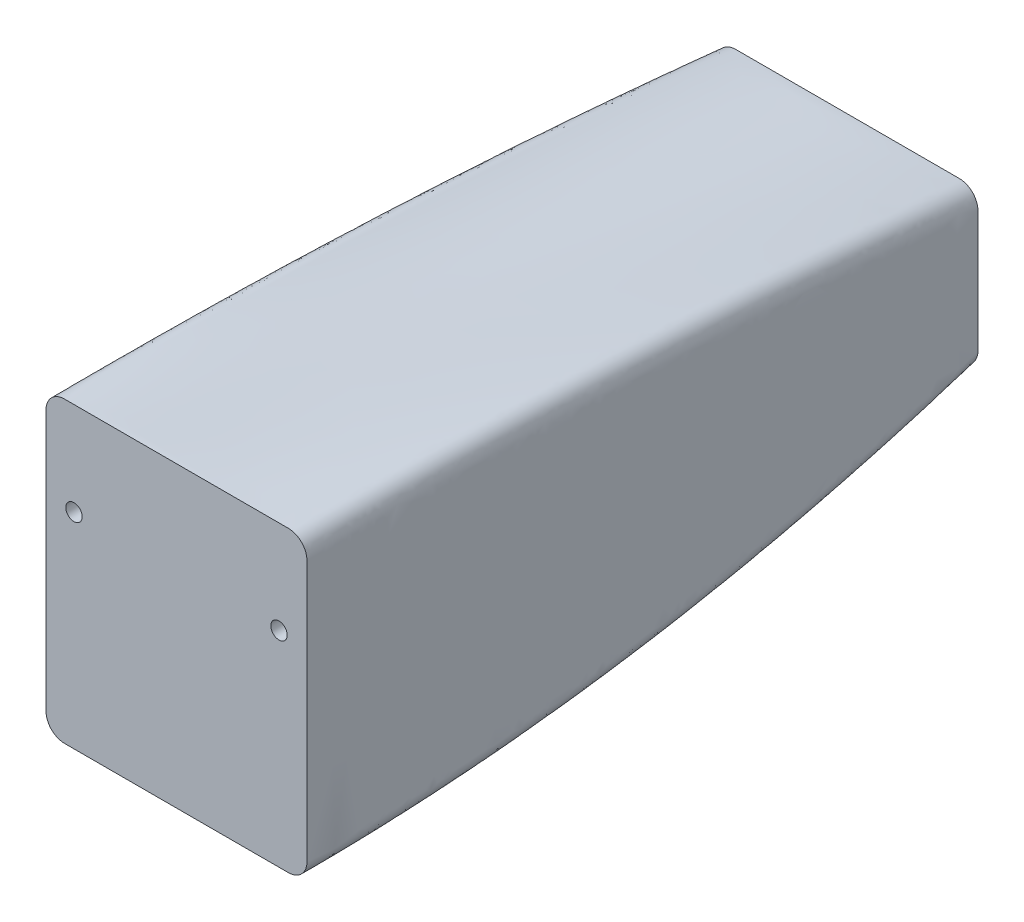
ISO-10303-21;
HEADER;
FILE_DESCRIPTION(('STEP AP214'),'2;1');
FILE_NAME('part.step','',(''),(''),'','','');
FILE_SCHEMA(('AUTOMOTIVE_DESIGN { 1 0 10303 214 1 1 1 1 }'));
ENDSEC;
DATA;
#1=APPLICATION_CONTEXT('core data for automotive mechanical design processes');
#2=APPLICATION_PROTOCOL_DEFINITION('international standard','automotive_design',2000,#1);
#3=PRODUCT_CONTEXT('',#1,'mechanical');
#4=PRODUCT('Part','Part','',(#3));
#5=PRODUCT_RELATED_PRODUCT_CATEGORY('part','',(#4));
#6=PRODUCT_DEFINITION_FORMATION('','',#4);
#7=PRODUCT_DEFINITION_CONTEXT('part definition',#1,'design');
#8=PRODUCT_DEFINITION('design','',#6,#7);
#9=PRODUCT_DEFINITION_SHAPE('','',#8);
#10=(LENGTH_UNIT() NAMED_UNIT(*) SI_UNIT(.MILLI.,.METRE.));
#11=(NAMED_UNIT(*) PLANE_ANGLE_UNIT() SI_UNIT($,.RADIAN.));
#12=(NAMED_UNIT(*) SI_UNIT($,.STERADIAN.) SOLID_ANGLE_UNIT());
#13=UNCERTAINTY_MEASURE_WITH_UNIT(LENGTH_MEASURE(1.E-05),#10,'distance_accuracy_value','');
#14=(GEOMETRIC_REPRESENTATION_CONTEXT(3) GLOBAL_UNCERTAINTY_ASSIGNED_CONTEXT((#13)) GLOBAL_UNIT_ASSIGNED_CONTEXT((#10,
#11,#12)) REPRESENTATION_CONTEXT('',''));
#15=CARTESIAN_POINT('',(0.,0.,0.));
#16=DIRECTION('',(0.,0.,1.));
#17=DIRECTION('',(1.,0.,0.));
#18=AXIS2_PLACEMENT_3D('',#15,#16,#17);
#19=CARTESIAN_POINT('',(-152.4,203.2,0.));
#20=CARTESIAN_POINT('',(-152.4,203.2,-76.289978704247));
#21=CARTESIAN_POINT('',(-152.399999999999,201.347916666664,-228.824946760615));
#22=CARTESIAN_POINT('',(-152.4,193.013541666668,-457.492430788806));
#23=CARTESIAN_POINT('',(-152.4,179.122916666665,-686.024946760615));
#24=CARTESIAN_POINT('',(-152.4,166.158333333333,-838.289978704247));
#25=CARTESIAN_POINT('',(-152.4,158.75,-914.4));
#26=CARTESIAN_POINT('',(-126.997882380431,203.2,0.));
#27=CARTESIAN_POINT('',(-126.998237758365,200.617013574214,-80.7921401352914));
#28=CARTESIAN_POINT('',(-126.998900053607,195.12526755,-235.53205080147));
#29=CARTESIAN_POINT('',(-126.999820805528,185.38199086321,-457.342481945236));
#30=CARTESIAN_POINT('',(-127.000741557449,173.604718393396,-679.087152191198));
#31=CARTESIAN_POINT('',(-127.00140385269,164.044980803145,-833.695541061777));
#32=CARTESIAN_POINT('',(-127.001759230624,158.750000000001,-914.400000000002));
#33=CARTESIAN_POINT('',(-76.1934056008883,203.2,0.));
#34=CARTESIAN_POINT('',(-76.1944596135134,197.84697607519,-85.460061123432));
#35=CARTESIAN_POINT('',(-76.1964194511055,188.452003717235,-242.491024038454));
#36=CARTESIAN_POINT('',(-76.1991473196214,177.197799223124,-457.202638478264));
#37=CARTESIAN_POINT('',(-76.2018789117132,167.686895859023,-671.913052111083));
#38=CARTESIAN_POINT('',(-76.2038436670242,161.778586485762,-828.941541190255));
#39=CARTESIAN_POINT('',(-76.2048976796493,158.75,-914.4));
#40=CARTESIAN_POINT('',(0.0101718947397991,203.2,0.));
#41=CARTESIAN_POINT('',(0.00854512829626252,198.394731070075,-84.1447095902575));
#42=CARTESIAN_POINT('',(0.0055279178554285,189.771614024762,-240.542565714426));
#43=CARTESIAN_POINT('',(0.00132280660836823,178.816188892012,-457.281606391949));
#44=CARTESIAN_POINT('',(-0.00289440625630244,168.857065624015,-673.983037675546));
#45=CARTESIAN_POINT('',(-0.00592759928524754,162.226749663394,-830.305440290817));
#46=CARTESIAN_POINT('',(-0.007554365728922,158.75,-914.4));
#47=CARTESIAN_POINT('',(76.2090542391531,203.2,0.));
#48=CARTESIAN_POINT('',(76.2076055518368,201.160302494155,-79.2040976481552));
#49=CARTESIAN_POINT('',(76.2049235601321,196.434133243936,-233.185975565563));
#50=CARTESIAN_POINT('',(76.2011820724959,186.987202918433,-457.457877873416));
#51=CARTESIAN_POINT('',(76.1974256905623,174.765320485615,-681.610827433119));
#52=CARTESIAN_POINT('',(76.1947240279792,164.48948991946,-835.354510966809));
#53=CARTESIAN_POINT('',(76.1932753406628,158.75,-914.4));
#54=CARTESIAN_POINT('',(127.003739298264,203.2,0.));
#55=CARTESIAN_POINT('',(127.003130464352,202.825897853524,-76.6214978184402));
#56=CARTESIAN_POINT('',(127.002004736661,200.446687234466,-229.328685152875));
#57=CARTESIAN_POINT('',(127.000433268093,191.908259993415,-457.512641542004));
#58=CARTESIAN_POINT('',(126.998854352375,178.323668144457,-685.552335739221));
#59=CARTESIAN_POINT('',(126.997718789246,165.852249758944,-837.970854246146));
#60=CARTESIAN_POINT('',(126.997109955333,158.75,-914.400000000001));
#61=CARTESIAN_POINT('',(154.061191964758,203.2,0.));
#62=CARTESIAN_POINT('',(154.061231789125,203.224470353609,-76.2682937445936));
#63=CARTESIAN_POINT('',(154.061305423972,201.406866884129,-228.791996785049));
#64=CARTESIAN_POINT('',(154.061408215128,193.085839122422,-457.491108785492));
#65=CARTESIAN_POINT('',(154.061511493407,179.175196222247,-686.055860667209));
#66=CARTESIAN_POINT('',(154.0615857716,166.178354531741,-838.310852918438));
#67=CARTESIAN_POINT('',(154.061625595966,158.75,-914.4));
#68=CARTESIAN_POINT('',(157.277351192376,202.875605593419,0.));
#69=CARTESIAN_POINT('',(157.302748002236,202.944809891288,-76.2331368313615));
#70=CARTESIAN_POINT('',(157.350076632585,201.190110354134,-228.738290001684));
#71=CARTESIAN_POINT('',(157.415876262133,192.892906398944,-457.488057521071));
#72=CARTESIAN_POINT('',(157.481677384916,178.944709715774,-686.104868617123));
#73=CARTESIAN_POINT('',(157.529007987383,165.888000370721,-838.344137903394));
#74=CARTESIAN_POINT('',(157.554404797243,158.422533288273,-914.400000000001));
#75=CARTESIAN_POINT('',(161.745725705935,201.566761344456,0.));
#76=CARTESIAN_POINT('',(161.85719397524,201.650577178658,-76.2018997428054));
#77=CARTESIAN_POINT('',(162.064926792692,199.898886193079,-228.689859196821));
#78=CARTESIAN_POINT('',(162.353728602105,191.530553961633,-457.483088829511));
#79=CARTESIAN_POINT('',(162.64253333666,177.438582852026,-686.145648762115));
#80=CARTESIAN_POINT('',(162.85027001735,164.239566406383,-838.372325551655));
#81=CARTESIAN_POINT('',(162.961738286654,156.691835508826,-914.399999999999));
#82=CARTESIAN_POINT('',(165.837665424983,199.514569024522,0.));
#83=CARTESIAN_POINT('',(166.032498949911,199.54873868353,-76.1890201986105));
#84=CARTESIAN_POINT('',(166.395592874104,197.6878985395,-228.669107629038));
#85=CARTESIAN_POINT('',(166.900385535622,189.116128583717,-457.478558321472));
#86=CARTESIAN_POINT('',(167.405182304081,174.770856005533,-686.159424937194));
#87=CARTESIAN_POINT('',(167.768281652311,161.362943639996,-838.382423871866));
#88=CARTESIAN_POINT('',(167.963115177239,153.69907017061,-914.400000000001));
#89=CARTESIAN_POINT('',(169.511774494994,196.759899801224,1.44738120204081E-13));
#90=CARTESIAN_POINT('',(169.741616271139,196.705160542827,-76.1913574618443));
#91=CARTESIAN_POINT('',(170.169951936683,194.670716591397,-228.671585165225));
#92=CARTESIAN_POINT('',(170.765447186749,185.833004371362,-457.475295975399));
#93=CARTESIAN_POINT('',(171.360947302594,171.198070362486,-686.151924952306));
#94=CARTESIAN_POINT('',(171.789289394371,157.569103481403,-838.378083365132));
#95=CARTESIAN_POINT('',(172.019131170516,149.784688216593,-914.399999999998));
#96=CARTESIAN_POINT('',(172.704730245152,193.307886858374,0.));
#97=CARTESIAN_POINT('',(172.906767946129,193.168824074474,-76.2057707955773));
#98=CARTESIAN_POINT('',(173.283286730919,190.979160171261,-228.692841672278));
#99=CARTESIAN_POINT('',(173.806744019291,181.931652891294,-457.474131769747));
#100=CARTESIAN_POINT('',(174.330206336469,167.092711405698,-686.128876617423));
#101=CARTESIAN_POINT('',(174.706731762804,153.320097080563,-838.362954532583));
#102=CARTESIAN_POINT('',(174.90876946378,145.459073494648,-914.400000000002));
#103=CARTESIAN_POINT('',(174.887047768038,189.824723880882,-1.23268842281302E-13));
#104=CARTESIAN_POINT('',(175.026818438545,189.650891769246,-76.2252280183268));
#105=CARTESIAN_POINT('',(175.287294725424,187.407170746303,-228.722496126284));
#106=CARTESIAN_POINT('',(175.649424202719,178.317905644492,-457.475601697421));
#107=CARTESIAN_POINT('',(176.011558204128,163.469420090984,-686.101485888309));
#108=CARTESIAN_POINT('',(176.272040466004,149.707184384607,-838.344398984863));
#109=CARTESIAN_POINT('',(176.411811136511,141.85434801314,-914.399999999999));
#110=CARTESIAN_POINT('',(176.267371262038,186.626295543058,1.2871974436324E-13));
#111=CARTESIAN_POINT('',(176.350397328331,186.459869291305,-76.243691094844));
#112=CARTESIAN_POINT('',(176.505123354506,184.24458301278,-228.751159041814));
#113=CARTESIAN_POINT('',(176.720233421317,175.240345547358,-457.478656688219));
#114=CARTESIAN_POINT('',(176.93534713773,160.520774180069,-686.077526939975));
#115=CARTESIAN_POINT('',(177.090077983939,146.874760579416,-838.327810884894));
#116=CARTESIAN_POINT('',(177.173104050232,139.087853906591,-914.399999999999));
#117=CARTESIAN_POINT('',(177.086963674345,183.996593571629,-1.28215291471455E-13));
#118=CARTESIAN_POINT('',(177.129389118678,183.856491008348,-76.258594459275));
#119=CARTESIAN_POINT('',(177.208451442463,181.704397741592,-228.774569637985));
#120=CARTESIAN_POINT('',(177.318369719897,172.831962331986,-457.481991202953));
#121=CARTESIAN_POINT('',(177.428290734068,158.286585977708,-686.059250522448));
#122=CARTESIAN_POINT('',(177.507356672266,144.788566190383,-838.314954291659));
#123=CARTESIAN_POINT('',(177.549782116599,137.084515958082,-914.4));
#124=CARTESIAN_POINT('',(177.646695892572,181.09990503322,0.));
#125=CARTESIAN_POINT('',(177.65693999592,181.011078377801,-76.2741612886315));
#126=CARTESIAN_POINT('',(177.676029429083,178.971980719869,-228.799337377042));
#127=CARTESIAN_POINT('',(177.702569731891,170.310846927028,-457.486472736627));
#128=CARTESIAN_POINT('',(177.729111579981,156.029063463017,-686.041382874886));
#129=CARTESIAN_POINT('',(177.748203054003,142.748641261977,-838.302138492805));
#130=CARTESIAN_POINT('',(177.758447157352,135.165600133049,-914.4));
#131=CARTESIAN_POINT('',(177.8,178.947801432061,-1.19329048133977E-13));
#132=CARTESIAN_POINT('',(177.80000008463,178.913753295433,-76.2847197567424));
#133=CARTESIAN_POINT('',(177.799999582751,176.990660801679,-228.816383120578));
#134=CARTESIAN_POINT('',(177.799999360821,168.534074292293,-457.490294269907));
#135=CARTESIAN_POINT('',(177.799999689739,154.498578019263,-686.030220940654));
#136=CARTESIAN_POINT('',(177.79999991537,141.417657014858,-838.293926031581));
#137=CARTESIAN_POINT('',(177.8,133.945057211016,-914.4));
#138=CARTESIAN_POINT('',(177.8,149.439134235658,1.08731525468806E-13));
#139=CARTESIAN_POINT('',(177.799997908886,150.280424902702,-76.419921305873));
#140=CARTESIAN_POINT('',(177.800010309713,150.182897026824,-229.036544549858));
#141=CARTESIAN_POINT('',(177.800015793404,144.868229195493,-457.545221736795));
#142=CARTESIAN_POINT('',(177.800007666189,134.557208308803,-685.894627780375));
#143=CARTESIAN_POINT('',(177.800002091114,124.46719629109,-838.19244474276));
#144=CARTESIAN_POINT('',(177.800000000001,118.646814229079,-914.4));
#145=CARTESIAN_POINT('',(177.8,90.9383271723927,0.));
#146=CARTESIAN_POINT('',(177.799983665125,92.1643911321974,-76.6550355022733));
#147=CARTESIAN_POINT('',(177.800080535026,93.8861220986339,-229.509520450412));
#148=CARTESIAN_POINT('',(177.800123371234,94.527293546052,-457.926459692636));
#149=CARTESIAN_POINT('',(177.80005988495,93.4773632022336,-686.008593897138));
#150=CARTESIAN_POINT('',(177.800016334875,91.8186245111077,-838.191406555604));
#151=CARTESIAN_POINT('',(177.8,90.7909120910423,-914.399999999999));
#152=CARTESIAN_POINT('',(177.8,0.0079139873784885,0.));
#153=CARTESIAN_POINT('',(177.799957105835,-0.110809432631002,-76.9250565213651));
#154=CARTESIAN_POINT('',(177.800211478985,1.83869962413879,-230.223555546046));
#155=CARTESIAN_POINT('',(177.800323963673,11.2968682439637,-458.912537425807));
#156=CARTESIAN_POINT('',(177.800157253422,27.2634428121314,-686.812388499132));
#157=CARTESIAN_POINT('',(177.800042894166,42.2343169232783,-838.527210689867));
#158=CARTESIAN_POINT('',(177.8,50.7961623228312,-914.4));
#159=CARTESIAN_POINT('',(177.8,-90.9262006583948,1.66553288356187E-13));
#160=CARTESIAN_POINT('',(177.799950343851,-92.3350950147008,-77.1040900099978));
#161=CARTESIAN_POINT('',(177.800244817257,-90.0809917571816,-230.797392165084));
#162=CARTESIAN_POINT('',(177.800375034417,-71.7754444363253,-459.900088578201));
#163=CARTESIAN_POINT('',(177.80018204339,-38.8350938652442,-687.758061723106));
#164=CARTESIAN_POINT('',(177.800049656149,-7.30611317419731,-838.955648446669));
#165=CARTESIAN_POINT('',(177.8,10.8011824179243,-914.400000000001));
#166=CARTESIAN_POINT('',(177.8,-149.434941907144,0.));
#167=CARTESIAN_POINT('',(177.799975694704,-150.349311589992,-77.1572291454801));
#168=CARTESIAN_POINT('',(177.800119831199,-146.121350985685,-230.989971112449));
#169=CARTESIAN_POINT('',(177.800183568859,-121.79785795889,-460.284273372492));
#170=CARTESIAN_POINT('',(177.800089105147,-79.6805312931429,-688.15578508383));
#171=CARTESIAN_POINT('',(177.800024305296,-39.8623234366139,-839.139877504594));
#172=CARTESIAN_POINT('',(177.8,-17.0500549629847,-914.4));
#173=CARTESIAN_POINT('',(177.8,-178.949787511064,0.));
#174=CARTESIAN_POINT('',(177.800000985224,-178.912723217439,-77.1662046934605));
#175=CARTESIAN_POINT('',(177.799995142598,-172.752013922219,-231.015637464214));
#176=CARTESIAN_POINT('',(177.799992558975,-145.243565005146,-460.341248412996));
#177=CARTESIAN_POINT('',(177.79999638809,-99.4601218797873,-688.217023206794));
#178=CARTESIAN_POINT('',(177.799999014776,-56.7495287481612,-839.166908048269));
#179=CARTESIAN_POINT('',(177.8,-32.3458673929579,-914.4));
#180=CARTESIAN_POINT('',(177.647241568389,-181.095184993793,0.));
#181=CARTESIAN_POINT('',(177.657427706366,-180.998214167073,-77.1668450337061));
#182=CARTESIAN_POINT('',(177.676387629468,-174.714649189105,-231.01740182398));
#183=CARTESIAN_POINT('',(177.702763378957,-147.000409867727,-460.345236159632));
#184=CARTESIAN_POINT('',(177.72915861544,-100.977358964007,-688.22133431908));
#185=CARTESIAN_POINT('',(177.748144275008,-58.076488618666,-839.168796723846));
#186=CARTESIAN_POINT('',(177.758330412985,-33.5679570644202,-914.4));
#187=CARTESIAN_POINT('',(177.088350583223,-183.991038305995,0.));
#188=CARTESIAN_POINT('',(177.130600148232,-183.834262072567,-77.1676372269462));
#189=CARTESIAN_POINT('',(177.209290970776,-177.425846792021,-231.019404347414));
#190=CARTESIAN_POINT('',(177.31872431271,-149.496191001681,-460.349961625006));
#191=CARTESIAN_POINT('',(177.428196908479,-103.217263686169,-688.226511750468));
#192=CARTESIAN_POINT('',(177.506939573532,-60.1109455135506,-839.171025928132));
#193=CARTESIAN_POINT('',(177.549189138541,-35.488852711518,-914.4));
#194=CARTESIAN_POINT('',(176.269225565707,-186.621374842444,0.));
#195=CARTESIAN_POINT('',(176.351968983036,-186.429850359192,-77.1682696869842));
#196=CARTESIAN_POINT('',(176.506102473463,-179.946453217569,-231.020824947012));
#197=CARTESIAN_POINT('',(176.720436222064,-151.880575507727,-460.35352874261));
#198=CARTESIAN_POINT('',(176.934828555977,-105.434485438875,-688.230491014276));
#199=CARTESIAN_POINT('',(177.089039419969,-62.1916189984402,-839.172699538166));
#200=CARTESIAN_POINT('',(177.171782837298,-37.4937100495588,-914.4));
#201=CARTESIAN_POINT('',(174.888855353859,-189.821592921503,0.));
#202=CARTESIAN_POINT('',(175.028248237403,-189.611971486156,-77.168911434668));
#203=CARTESIAN_POINT('',(175.287926507675,-183.085108879076,-231.022025971198));
#204=CARTESIAN_POINT('',(175.649014324604,-154.928282500915,-460.356870844795));
#205=CARTESIAN_POINT('',(176.01018513389,-108.361685451593,-688.234320568528));
#206=CARTESIAN_POINT('',(176.269973012086,-65.0166349556078,-839.174254512309));
#207=CARTESIAN_POINT('',(176.409365895629,-40.261453498951,-914.400000000002));
#208=CARTESIAN_POINT('',(172.705262124919,-193.307600423863,0.));
#209=CARTESIAN_POINT('',(172.906919312379,-193.121085198703,-77.1693572059019));
#210=CARTESIAN_POINT('',(173.282603912469,-186.631778791615,-231.022382903729));
#211=CARTESIAN_POINT('',(173.804991682447,-158.509790431357,-460.358641637131));
#212=CARTESIAN_POINT('',(174.327488911055,-111.9611462359,-688.236567439692));
#213=CARTESIAN_POINT('',(174.703318073042,-68.6203132282286,-839.175050318481));
#214=CARTESIAN_POINT('',(174.904975260502,-43.86597982835,-914.399999999999));
#215=CARTESIAN_POINT('',(169.509530648444,-196.762207371481,0.));
#216=CARTESIAN_POINT('',(169.739277044482,-196.650830610548,-77.1693905414066));
#217=CARTESIAN_POINT('',(170.167285090411,-190.303604592941,-231.021477005469));
#218=CARTESIAN_POINT('',(170.762432974934,-162.385319152253,-460.357698105764));
#219=CARTESIAN_POINT('',(171.357710882962,-116.046239967236,-688.235928126148));
#220=CARTESIAN_POINT('',(171.78589065079,-72.8595469061958,-839.174554346102));
#221=CARTESIAN_POINT('',(172.015637046829,-48.1883665420547,-914.399999999999));
#222=CARTESIAN_POINT('',(165.832432932656,-199.517982100316,1.62694408673306E-13));
#223=CARTESIAN_POINT('',(166.027771864582,-199.493317922224,-77.1689909583507));
#224=CARTESIAN_POINT('',(166.391651348859,-193.316384312118,-231.019733628936));
#225=CARTESIAN_POINT('',(166.897648902531,-165.661831326453,-460.354468546686));
#226=CARTESIAN_POINT('',(167.403781123335,-119.61249490092,-688.23268180935));
#227=CARTESIAN_POINT('',(167.767838462346,-76.6481905853619,-839.172993152547));
#228=CARTESIAN_POINT('',(167.963177394271,-52.0984480208617,-914.400000000001));
#229=CARTESIAN_POINT('',(161.73850067078,-201.569625930582,-1.28318877220235E-13));
#230=CARTESIAN_POINT('',(161.851088651272,-201.601682711168,-77.1682271281502));
#231=CARTESIAN_POINT('',(162.060769617021,-195.543776103088,-231.017649513152));
#232=CARTESIAN_POINT('',(162.352379796822,-168.096274417314,-460.349735414354));
#233=CARTESIAN_POINT('',(162.644108639545,-122.294171735602,-688.227557044984));
#234=CARTESIAN_POINT('',(162.853946323282,-79.5289983105404,-839.170752456427));
#235=CARTESIAN_POINT('',(162.966534303774,-55.089398856502,-914.4));
#236=CARTESIAN_POINT('',(157.270705396878,-202.876735938383,0.));
#237=CARTESIAN_POINT('',(157.297243446235,-202.912497685213,-77.1671677222203));
#238=CARTESIAN_POINT('',(157.346608178658,-196.877429629934,-231.015721397142));
#239=CARTESIAN_POINT('',(157.415303951597,-169.511626414094,-460.344281163225));
#240=CARTESIAN_POINT('',(157.484077008812,-123.839600711584,-688.221282388742));
#241=CARTESIAN_POINT('',(157.533543810492,-81.19334804795,-839.168217976355));
#242=CARTESIAN_POINT('',(157.560081859849,-56.8215589366125,-914.399999999999));
#243=CARTESIAN_POINT('',(154.064204145434,-203.2,0.));
#244=CARTESIAN_POINT('',(154.064185415456,-203.21175217869,-77.1663101820587));
#245=CARTESIAN_POINT('',(154.06411502878,-197.14296164004,-231.014871145667));
#246=CARTESIAN_POINT('',(154.064042768203,-169.765010746678,-460.340685886248));
#247=CARTESIAN_POINT('',(154.064000138785,-124.114569700303,-688.216818393792));
#248=CARTESIAN_POINT('',(154.063968885951,-81.5012820855945,-839.166589612752));
#249=CARTESIAN_POINT('',(154.063950155973,-57.15,-914.4));
#250=CARTESIAN_POINT('',(126.99788238043,-203.2,0.));
#251=CARTESIAN_POINT('',(126.998168271502,-203.020616823852,-77.1589078293539));
#252=CARTESIAN_POINT('',(126.999242641259,-196.681421880859,-231.01107279321));
#253=CARTESIAN_POINT('',(127.000345613944,-169.198990453813,-460.313736620812));
#254=CARTESIAN_POINT('',(127.000996301819,-123.70819584886,-688.181350342373));
#255=CARTESIAN_POINT('',(127.001473339553,-81.3448986134553,-839.154642648701));
#256=CARTESIAN_POINT('',(127.001759230624,-57.1500000000001,-914.400000000002));
#257=CARTESIAN_POINT('',(81.8383474652821,-203.2,1.16551939786532E-13));
#258=CARTESIAN_POINT('',(81.8387609493471,-202.904620820856,-77.1356340389032));
#259=CARTESIAN_POINT('',(81.8439147683914,-196.394804884362,-231.084086553553));
#260=CARTESIAN_POINT('',(81.8479179887998,-168.847605762373,-460.327021448765));
#261=CARTESIAN_POINT('',(81.8482606287592,-123.473439790135,-688.143381090826));
#262=CARTESIAN_POINT('',(81.8485799234705,-81.2499927928224,-839.167683053042));
#263=CARTESIAN_POINT('',(81.8489934075356,-57.1500000000001,-914.400000000001));
#264=CARTESIAN_POINT('',(31.0357300479237,-203.2,1.16616412885212E-13));
#265=CARTESIAN_POINT('',(31.0363750539542,-202.858048285412,-77.1625732406333));
#266=CARTESIAN_POINT('',(31.0433997789138,-196.279920104578,-231.16333849944));
#267=CARTESIAN_POINT('',(31.0489656802636,-168.706756814837,-460.326815110587));
#268=CARTESIAN_POINT('',(31.0496688842844,-123.378834968735,-688.069284543264));
#269=CARTESIAN_POINT('',(31.050271450555,-81.2118879910951,-839.133719327992));
#270=CARTESIAN_POINT('',(31.0509164565856,-57.15,-914.4));
#271=CARTESIAN_POINT('',(-19.7654376877358,-203.2,0.));
#272=CARTESIAN_POINT('',(-19.7640977932184,-202.717854724286,-77.2521924531448));
#273=CARTESIAN_POINT('',(-19.7597400606519,-195.949577834162,-231.170269616197));
#274=CARTESIAN_POINT('',(-19.755023933372,-168.301489378946,-460.260489264889));
#275=CARTESIAN_POINT('',(-19.7518617000456,-123.065868023094,-687.945249773377));
#276=CARTESIAN_POINT('',(-19.7495561934086,-81.0971841683555,-839.022269571895));
#277=CARTESIAN_POINT('',(-19.7482162988911,-57.15,-914.399999999999));
#278=CARTESIAN_POINT('',(-59.2759692737279,-203.2,0.));
#279=CARTESIAN_POINT('',(-59.2740918875923,-202.631551521089,-77.3313753753843));
#280=CARTESIAN_POINT('',(-59.2736430156583,-195.750833180113,-231.136866475016));
#281=CARTESIAN_POINT('',(-59.2708189348542,-168.057583958106,-460.197277993241));
#282=CARTESIAN_POINT('',(-59.2654477903113,-122.864807442298,-687.86273449647));
#283=CARTESIAN_POINT('',(-59.261635014267,-81.0265724566483,-838.92771801626));
#284=CARTESIAN_POINT('',(-59.2597576281315,-57.1500000000001,-914.4));
#285=CARTESIAN_POINT('',(-98.7841313145234,-203.2,1.50692083274478E-13));
#286=CARTESIAN_POINT('',(-98.7839157700931,-203.118563837138,-77.17492612236));
#287=CARTESIAN_POINT('',(-98.7772416817108,-196.906686153331,-231.208196477837));
#288=CARTESIAN_POINT('',(-98.7724876587369,-169.475446992031,-460.372877406722));
#289=CARTESIAN_POINT('',(-98.7729719117889,-123.936919036187,-688.097001521762));
#290=CARTESIAN_POINT('',(-98.7732160084336,-81.4250370788715,-839.147557466817));
#291=CARTESIAN_POINT('',(-98.773000464003,-57.1499999999998,-914.4));
#292=CARTESIAN_POINT('',(-124.18161201205,-203.199999999999,3.26281044915001E-13));
#293=CARTESIAN_POINT('',(-124.183241365638,-203.634184157587,-76.9892739662352));
#294=CARTESIAN_POINT('',(-124.16875129564,-198.127851676084,-231.295234811252));
#295=CARTESIAN_POINT('',(-124.161249365533,-170.973474047862,-460.572184531127));
#296=CARTESIAN_POINT('',(-124.168384455972,-125.076712186071,-688.359378917627));
#297=CARTESIAN_POINT('',(-124.173225481917,-81.8469082501481,-839.401931733866));
#298=CARTESIAN_POINT('',(-124.174854835504,-57.1499999999994,-914.399999999999));
#299=CARTESIAN_POINT('',(-141.112773021451,-203.2,0.));
#300=CARTESIAN_POINT('',(-141.112773021451,-203.2,-77.1658550398281));
#301=CARTESIAN_POINT('',(-141.110668014604,-197.110653451798,-231.076577549104));
#302=CARTESIAN_POINT('',(-141.109259987614,-169.725458102117,-460.355420050345));
#303=CARTESIAN_POINT('',(-141.109609919468,-124.096735935857,-688.185918242858));
#304=CARTESIAN_POINT('',(-141.109826646814,-81.4916666666665,-839.165855039828));
#305=CARTESIAN_POINT('',(-141.109826646814,-57.15,-914.4));
#306=CARTESIAN_POINT('',(-153.876615079785,-203.2,0.));
#307=CARTESIAN_POINT('',(-153.876615079785,-203.2,-77.1658550398281));
#308=CARTESIAN_POINT('',(-153.876890460519,-197.115097447414,-231.006534505361));
#309=CARTESIAN_POINT('',(-153.877074661111,-169.730829767017,-460.336884557358));
#310=CARTESIAN_POINT('',(-153.877028882404,-124.088647617167,-688.218394716817));
#311=CARTESIAN_POINT('',(-153.877000529748,-81.4916666666665,-839.165855039827));
#312=CARTESIAN_POINT('',(-153.877000529748,-57.15,-914.4));
#313=CARTESIAN_POINT('',(-155.490596065922,-203.055824708187,0.));
#314=CARTESIAN_POINT('',(-155.501850633345,-203.061272620721,-77.1635884888161));
#315=CARTESIAN_POINT('',(-155.523252819871,-196.984274267793,-230.999032586125));
#316=CARTESIAN_POINT('',(-155.552698510756,-169.602781536998,-460.336938940777));
#317=CARTESIAN_POINT('',(-155.581786960996,-123.954853630667,-688.225400923915));
#318=CARTESIAN_POINT('',(-155.602717340221,-81.350810867041,-839.168885261918));
#319=CARTESIAN_POINT('',(-155.613971907645,-57.0044592392328,-914.400000000001));
#320=CARTESIAN_POINT('',(-157.564408029446,-202.677141496077,0.));
#321=CARTESIAN_POINT('',(-157.602068872022,-202.692381498101,-77.1565170434684));
#322=CARTESIAN_POINT('',(-157.672580419552,-196.625470583071,-230.992635572749));
#323=CARTESIAN_POINT('',(-157.770373918432,-169.233441551852,-460.341632480535));
#324=CARTESIAN_POINT('',(-157.867895638741,-123.551684652538,-688.239407848334));
#325=CARTESIAN_POINT('',(-157.938048248634,-80.9097502118172,-839.178354672298));
#326=CARTESIAN_POINT('',(-157.975709091211,-56.5413090438876,-914.4));
#327=CARTESIAN_POINT('',(-159.263295420624,-202.293897038325,0.));
#328=CARTESIAN_POINT('',(-159.326924948338,-202.316608511279,-77.1496309036685));
#329=CARTESIAN_POINT('',(-159.445670430081,-196.255558903904,-230.98824800263));
#330=CARTESIAN_POINT('',(-159.610637902115,-168.847905055467,-460.346689857354));
#331=CARTESIAN_POINT('',(-159.775469097207,-123.12822437028,-688.252192892399));
#332=CARTESIAN_POINT('',(-159.894034598156,-80.4453435166112,-839.187575558262));
#333=CARTESIAN_POINT('',(-159.95766412587,-56.0533342751857,-914.400000000001));
#334=CARTESIAN_POINT('',(-162.200385674718,-201.338739975574,-1.20447079747563E-13));
#335=CARTESIAN_POINT('',(-162.321116413814,-201.355490096325,-77.1393670974565));
#336=CARTESIAN_POINT('',(-162.546113571331,-195.271614186673,-230.979406465841));
#337=CARTESIAN_POINT('',(-162.858915246449,-167.79710634623,-460.353565224946));
#338=CARTESIAN_POINT('',(-163.17171778849,-121.977334462791,-688.272236288579));
#339=CARTESIAN_POINT('',(-163.396716090957,-79.2029163291812,-839.201283451308));
#340=CARTESIAN_POINT('',(-163.517446830053,-54.7593060268018,-914.4));
#341=CARTESIAN_POINT('',(-165.837665424983,-199.514569024522,1.78908171496481E-13));
#342=CARTESIAN_POINT('',(-166.032499874998,-199.476638296849,-77.1301189821453));
#343=CARTESIAN_POINT('',(-166.395588313192,-193.280855359527,-230.967377838696));
#344=CARTESIAN_POINT('',(-166.900378548783,-165.619755110253,-460.358582580159));
#345=CARTESIAN_POINT('',(-167.405178912637,-119.583514526871,-688.292026087576));
#346=CARTESIAN_POINT('',(-167.768280727223,-76.6372857478635,-839.213566029799));
#347=CARTESIAN_POINT('',(-167.963115177238,-52.0990701706109,-914.399999999999));
#348=CARTESIAN_POINT('',(-168.831383926474,-197.270023731464,-1.43722918451365E-13));
#349=CARTESIAN_POINT('',(-169.054731623769,-197.154580132667,-77.1260286155468));
#350=CARTESIAN_POINT('',(-169.471051129469,-190.810374694139,-230.959152846162));
#351=CARTESIAN_POINT('',(-170.04977863193,-162.929852506334,-460.359938873942));
#352=CARTESIAN_POINT('',(-170.628438809969,-116.661209903022,-688.301985069404));
#353=CARTESIAN_POINT('',(-171.044669400393,-73.5418615713772,-839.218935449298));
#354=CARTESIAN_POINT('',(-171.268017097688,-48.9095737636333,-914.4));
#355=CARTESIAN_POINT('',(-171.049123559885,-195.097819495407,0.));
#356=CARTESIAN_POINT('',(-171.265559081266,-194.926041236104,-77.1249826501708));
#357=CARTESIAN_POINT('',(-171.669059190329,-188.476097246537,-230.955889816262));
#358=CARTESIAN_POINT('',(-172.229919602845,-160.445736744234,-460.359913364381));
#359=CARTESIAN_POINT('',(-172.790660590597,-114.024275656138,-688.304971658149));
#360=CARTESIAN_POINT('',(-173.194002975522,-70.7940780940079,-839.220264659548));
#361=CARTESIAN_POINT('',(-173.410438496903,-46.1019848319529,-914.400000000001));
#362=CARTESIAN_POINT('',(-173.092697804776,-192.688657884598,0.));
#363=CARTESIAN_POINT('',(-173.283642832494,-192.471745523811,-77.1254397334659));
#364=CARTESIAN_POINT('',(-173.639668110827,-185.938485250673,-230.955583977805));
#365=CARTESIAN_POINT('',(-174.134505158933,-157.79453231942,-460.359342277344));
#366=CARTESIAN_POINT('',(-174.629197577832,-111.261519161353,-688.304284153648));
#367=CARTESIAN_POINT('',(-174.985031844547,-67.9524970719036,-839.219600756965));
#368=CARTESIAN_POINT('',(-175.175976872265,-43.2182334090468,-914.4));
#369=CARTESIAN_POINT('',(-174.887047768038,-189.824723880882,-1.85227453155586E-13));
#370=CARTESIAN_POINT('',(-175.026797044569,-189.590032235433,-77.1288729044607));
#371=CARTESIAN_POINT('',(-175.287400203087,-183.027532557908,-230.960495079602));
#372=CARTESIAN_POINT('',(-175.649585783458,-154.85513632845,-460.357525142103));
#373=CARTESIAN_POINT('',(-176.011636636145,-108.305502089279,-688.296622537549));
#374=CARTESIAN_POINT('',(-176.27206185998,-64.9907235539118,-839.214992535601));
#375=CARTESIAN_POINT('',(-176.411811136511,-40.25434801314,-914.4));
#376=CARTESIAN_POINT('',(-176.267371262038,-186.626295543059,0.));
#377=CARTESIAN_POINT('',(-176.350380843471,-186.414132723279,-77.1359399637317));
#378=CARTESIAN_POINT('',(-176.505204628997,-179.901305993337,-230.971016393009));
#379=CARTESIAN_POINT('',(-176.720357925329,-151.822171379829,-460.353998449412));
#380=CARTESIAN_POINT('',(-176.935407572537,-105.389294339918,-688.280817033518));
#381=CARTESIAN_POINT('',(-177.090094468799,-62.1706730843649,-839.205576880309));
#382=CARTESIAN_POINT('',(-177.173104050232,-37.4878539065916,-914.4));
#383=CARTESIAN_POINT('',(-177.086963674345,-183.996593571629,0.));
#384=CARTESIAN_POINT('',(-177.129377535816,-183.824166101775,-77.143340184617));
#385=CARTESIAN_POINT('',(-177.208508548877,-177.393359306964,-230.981988928902));
#386=CARTESIAN_POINT('',(-177.318457200945,-149.453327311727,-460.350322975162));
#387=CARTESIAN_POINT('',(-177.428333197762,-103.183888142246,-688.26433102673));
#388=CARTESIAN_POINT('',(-177.507368255128,-60.0954518728841,-839.195736991457));
#389=CARTESIAN_POINT('',(-177.549782116599,-35.4845159580825,-914.400000000001));
#390=CARTESIAN_POINT('',(-177.646695892572,-181.09990503322,0.));
#391=CARTESIAN_POINT('',(-177.656934071889,-180.994000873382,-77.153076920024));
#392=CARTESIAN_POINT('',(-177.676058636044,-174.697592323938,-230.996253094423));
#393=CARTESIAN_POINT('',(-177.7026144739,-146.977161522241,-460.345465926055));
#394=CARTESIAN_POINT('',(-177.729133297952,-100.95908948501,-688.242756741734));
#395=CARTESIAN_POINT('',(-177.748208978035,-58.0680020916947,-839.182806798063));
#396=CARTESIAN_POINT('',(-177.758447157352,-33.5656001330488,-914.4));
#397=CARTESIAN_POINT('',(-177.8,-178.947801432061,0.));
#398=CARTESIAN_POINT('',(-177.799998128822,-178.907908755308,-77.161283478704));
#399=CARTESIAN_POINT('',(-177.800009225375,-172.743275897986,-231.008097010384));
#400=CARTESIAN_POINT('',(-177.800014132313,-145.233507398161,-460.341339429995));
#401=CARTESIAN_POINT('',(-177.800006859886,-99.4527068275665,-688.2246774333));
#402=CARTESIAN_POINT('',(-177.800001871178,-56.746208451725,-839.171918361335));
#403=CARTESIAN_POINT('',(-177.8,-32.3450572110156,-914.4));
#404=CARTESIAN_POINT('',(-177.799999999999,-149.439134235659,0.));
#405=CARTESIAN_POINT('',(-177.800046234675,-150.424836830873,-77.2788131070932));
#406=CARTESIAN_POINT('',(-177.799772051455,-146.296761988956,-231.176248106962));
#407=CARTESIAN_POINT('',(-177.799650806702,-122.010717516315,-460.281937807682));
#408=CARTESIAN_POINT('',(-177.799830499996,-79.8336711720017,-687.966564745801));
#409=CARTESIAN_POINT('',(-177.799953765324,-39.9186848383821,-839.016037272977));
#410=CARTESIAN_POINT('',(-177.8,-17.0468142290797,-914.4));
#411=CARTESIAN_POINT('',(-177.8,-90.9383271723927,0.));
#412=CARTESIAN_POINT('',(-177.800094082012,-92.8760983891134,-78.0765273362868));
#413=CARTESIAN_POINT('',(-177.799536152097,-91.365749619061,-232.254852215352));
#414=CARTESIAN_POINT('',(-177.799289433583,-73.3447896463847,-459.86578553971));
#415=CARTESIAN_POINT('',(-177.799655087856,-39.9674195259213,-686.249144238659));
#416=CARTESIAN_POINT('',(-177.799905917988,-7.73426378191771,-837.960442379857));
#417=CARTESIAN_POINT('',(-177.8,10.8090879089576,-914.399999999998));
#418=CARTESIAN_POINT('',(-177.8,-0.00791398737865604,0.));
#419=CARTESIAN_POINT('',(-177.800080372493,-1.49823100251119,-79.4927560189391));
#420=CARTESIAN_POINT('',(-177.799603743461,-1.47989737513544,-234.052200361163));
#421=CARTESIAN_POINT('',(-177.799392976477,7.23464999396418,-458.81243842916));
#422=CARTESIAN_POINT('',(-177.799705348044,24.3291305939736,-682.83085582257));
#423=CARTESIAN_POINT('',(-177.799919627507,41.1158621146359,-835.896512101868));
#424=CARTESIAN_POINT('',(-177.8,50.8038376771687,-914.400000000001));
#425=CARTESIAN_POINT('',(-177.8,90.9262006583945,1.15424145908399E-13));
#426=CARTESIAN_POINT('',(-177.800029567977,90.5713554483212,-79.6329050953295));
#427=CARTESIAN_POINT('',(-177.79985422246,90.0664688914596,-233.942283192632));
#428=CARTESIAN_POINT('',(-177.799776684075,89.8491224411628,-457.806764274747));
#429=CARTESIAN_POINT('',(-177.799891601442,90.0983400444777,-681.392076494565));
#430=CARTESIAN_POINT('',(-177.799970432023,90.5297201956445,-835.139384025494));
#431=CARTESIAN_POINT('',(-177.8,90.7988175820755,-914.4));
#432=CARTESIAN_POINT('',(-177.8,149.434941907144,0.));
#433=CARTESIAN_POINT('',(-177.80000322532,149.503544788845,-77.8784601119981));
#434=CARTESIAN_POINT('',(-177.799984098365,148.317555793357,-231.20635667234));
#435=CARTESIAN_POINT('',(-177.799975640363,142.582819041515,-457.485957919053));
#436=CARTESIAN_POINT('',(-177.799988175721,132.906270098559,-683.633674163597));
#437=CARTESIAN_POINT('',(-177.79999677468,123.83699908416,-836.69739353561));
#438=CARTESIAN_POINT('',(-177.8,118.650054962984,-914.4));
#439=CARTESIAN_POINT('',(-177.8,178.949787511064,0.));
#440=CARTESIAN_POINT('',(-177.799999869261,178.947006669355,-76.2255890570193));
#441=CARTESIAN_POINT('',(-177.800000644577,177.067922969995,-228.728415480253));
#442=CARTESIAN_POINT('',(-177.800000987427,168.628170727997,-457.492693168837));
#443=CARTESIAN_POINT('',(-177.800000479301,154.566726687004,-686.12187782836));
#444=CARTESIAN_POINT('',(-177.800000130739,141.44424551185,-838.354534698851));
#445=CARTESIAN_POINT('',(-177.8,133.945867392958,-914.4));
#446=CARTESIAN_POINT('',(-177.647241568388,181.095184993793,0.));
#447=CARTESIAN_POINT('',(-177.657424352943,181.102335571824,-76.0944724029349));
#448=CARTESIAN_POINT('',(-177.676404162684,179.198771657847,-228.532022501822));
#449=CARTESIAN_POINT('',(-177.702788706111,170.591315644341,-457.493766321793));
#450=CARTESIAN_POINT('',(-177.729170909356,156.233222288405,-686.319915031488));
#451=CARTESIAN_POINT('',(-177.748147628431,142.828345525584,-838.486320299556));
#452=CARTESIAN_POINT('',(-177.758330412985,135.16795706442,-914.4));
#453=CARTESIAN_POINT('',(-177.088350583223,183.991038305995,1.66442066752005E-13));
#454=CARTESIAN_POINT('',(-177.130593503598,184.043828033301,-75.8966275047829));
#455=CARTESIAN_POINT('',(-177.20932373049,182.163946892986,-228.236102496659));
#456=CARTESIAN_POINT('',(-177.318774497159,173.398579626201,-457.496694310317));
#457=CARTESIAN_POINT('',(-177.428221268239,158.698482086273,-686.620332097847));
#458=CARTESIAN_POINT('',(-177.506946218166,144.949075238999,-838.685976535261));
#459=CARTESIAN_POINT('',(-177.549189138541,137.088852711518,-914.400000000001));
#460=CARTESIAN_POINT('',(-176.269225565707,186.621374842443,0.));
#461=CARTESIAN_POINT('',(-176.351959193748,186.742422982362,-75.7034548514672));
#462=CARTESIAN_POINT('',(-176.506150737111,184.932659976062,-227.947512669593));
#463=CARTESIAN_POINT('',(-176.720510156919,176.087246690492,-457.500613638327));
#464=CARTESIAN_POINT('',(-176.93486444429,161.135846806319,-686.914946484623));
#465=CARTESIAN_POINT('',(-177.089049209257,147.114026902246,-838.881567605775));
#466=CARTESIAN_POINT('',(-177.171782837298,139.093710049559,-914.4));
#467=CARTESIAN_POINT('',(-174.888855353859,189.821592921503,0.));
#468=CARTESIAN_POINT('',(-175.028234559421,190.05446844081,-75.4599105226447));
#469=CARTESIAN_POINT('',(-175.287993943549,188.384258580728,-227.584047425116));
#470=CARTESIAN_POINT('',(-175.649117629301,179.518752632565,-457.506725302192));
#471=CARTESIAN_POINT('',(-176.010235278457,164.340715419934,-687.287810172553));
#472=CARTESIAN_POINT('',(-176.269986690066,150.045344585173,-839.128878146428));
#473=CARTESIAN_POINT('',(-176.409365895629,141.861453498951,-914.399999999998));
#474=CARTESIAN_POINT('',(-172.705262124919,193.307600423862,0.));
#475=CARTESIAN_POINT('',(-172.90690154782,193.704265232461,-75.1963715330192));
#476=CARTESIAN_POINT('',(-173.282691496201,192.269787358147,-227.191344892821));
#477=CARTESIAN_POINT('',(-173.805125851553,183.515843240347,-457.515208632747));
#478=CARTESIAN_POINT('',(-174.327554037345,168.240834642935,-687.693563377281));
#479=CARTESIAN_POINT('',(-174.703335837601,153.764127195244,-839.397638410095));
#480=CARTESIAN_POINT('',(-174.904975260502,145.46597982835,-914.400000000002));
#481=CARTESIAN_POINT('',(-169.509530648444,196.762207371481,0.));
#482=CARTESIAN_POINT('',(-169.739256267517,197.343070440622,-74.9922883146084));
#483=CARTESIAN_POINT('',(-170.167387526061,196.204304291087,-226.887994016238));
#484=CARTESIAN_POINT('',(-170.762589895624,187.71354110465,-457.524123273764));
#485=CARTESIAN_POINT('',(-171.357787052973,172.558999534406,-688.010633444674));
#486=CARTESIAN_POINT('',(-171.785911427756,158.09259161565,-839.607202068352));
#487=CARTESIAN_POINT('',(-172.015637046829,149.788366542054,-914.399999999999));
#488=CARTESIAN_POINT('',(-165.832432932656,199.517982100316,0.));
#489=CARTESIAN_POINT('',(-166.027750619328,200.209853487787,-74.9471059602354));
#490=CARTESIAN_POINT('',(-166.391756093287,199.275607831901,-226.821821026723));
#491=CARTESIAN_POINT('',(-166.897809360027,191.061827897473,-457.52915720234));
#492=CARTESIAN_POINT('',(-167.403859010127,176.17717139551,-688.084558203817));
#493=CARTESIAN_POINT('',(-167.7678597076,161.901113623853,-839.655473069783));
#494=CARTESIAN_POINT('',(-167.963177394271,153.698448020862,-914.400000000001));
#495=CARTESIAN_POINT('',(-161.73850067078,201.569625930582,0.));
#496=CARTESIAN_POINT('',(-161.851070134479,202.232745789182,-75.1075617647964));
#497=CARTESIAN_POINT('',(-162.060860909455,201.297128330795,-227.062111649167));
#498=CARTESIAN_POINT('',(-162.352519647273,193.243786626795,-457.527695061671));
#499=CARTESIAN_POINT('',(-162.644176523584,178.676175658481,-687.842026124731));
#500=CARTESIAN_POINT('',(-162.853964840076,164.711989313763,-839.494107415691));
#501=CARTESIAN_POINT('',(-162.966534303774,156.689398856502,-914.4));
#502=CARTESIAN_POINT('',(-157.270705396878,202.876735938383,0.));
#503=CARTESIAN_POINT('',(-157.29723150728,203.323315890425,-75.5203930231888));
#504=CARTESIAN_POINT('',(-157.346667040696,202.10028764812,-227.678151608464));
#505=CARTESIAN_POINT('',(-157.415394122077,194.008530826489,-457.517121494962));
#506=CARTESIAN_POINT('',(-157.484120777969,179.750907297204,-687.209725677442));
#507=CARTESIAN_POINT('',(-157.533555749446,166.196138700699,-839.074761107388));
#508=CARTESIAN_POINT('',(-157.560081859849,158.421558936612,-914.4));
#509=CARTESIAN_POINT('',(-154.064204145434,203.2,0.));
#510=CARTESIAN_POINT('',(-154.064180863067,203.369222770391,-75.9950223612693));
#511=CARTESIAN_POINT('',(-154.0641374732,201.755589704425,-228.385534955827));
#512=CARTESIAN_POINT('',(-154.064077150704,193.513518033734,-457.502254595262));
#513=CARTESIAN_POINT('',(-154.064016828207,179.484438039774,-686.479472113796));
#514=CARTESIAN_POINT('',(-154.06397343834,166.29678832729,-838.590980466582));
#515=CARTESIAN_POINT('',(-154.063950155973,158.75,-914.4));
#516=CARTESIAN_POINT('',(-152.4,203.2,0.));
#517=CARTESIAN_POINT('',(-152.4,203.2,-76.289978704247));
#518=CARTESIAN_POINT('',(-152.399999999999,201.347916666664,-228.824946760615));
#519=CARTESIAN_POINT('',(-152.4,193.013541666668,-457.492430788806));
#520=CARTESIAN_POINT('',(-152.4,179.122916666665,-686.024946760615));
#521=CARTESIAN_POINT('',(-152.4,166.158333333333,-838.289978704247));
#522=CARTESIAN_POINT('',(-152.4,158.75,-914.4));
#523=B_SPLINE_SURFACE_WITH_KNOTS('',3,3,((#19,#20,#21,#22,#23,#24,#25),(#26,#27,#28,#29,#30,#31,
#32),(#33,#34,#35,#36,#37,#38,#39),(#40,#41,#42,#43,#44,#45,#46),(#47,#48,#49,#50,#51,#52,#53),
(#54,#55,#56,#57,#58,#59,#60),(#61,#62,#63,#64,#65,#66,#67),(#68,#69,#70,#71,#72,#73,#74),(#75,
#76,#77,#78,#79,#80,#81),(#82,#83,#84,#85,#86,#87,#88),(#89,#90,#91,#92,#93,#94,#95),(#96,#97,
#98,#99,#100,#101,#102),(#103,#104,#105,#106,#107,#108,#109),(#110,#111,#112,#113,#114,#115,
#116),(#117,#118,#119,#120,#121,#122,#123),(#124,#125,#126,#127,#128,#129,#130),(#131,#132,#133,
#134,#135,#136,#137),(#138,#139,#140,#141,#142,#143,#144),(#145,#146,#147,#148,#149,#150,#151),
(#152,#153,#154,#155,#156,#157,#158),(#159,#160,#161,#162,#163,#164,#165),(#166,#167,#168,#169,
#170,#171,#172),(#173,#174,#175,#176,#177,#178,#179),(#180,#181,#182,#183,#184,#185,#186),(#187,
#188,#189,#190,#191,#192,#193),(#194,#195,#196,#197,#198,#199,#200),(#201,#202,#203,#204,#205,
#206,#207),(#208,#209,#210,#211,#212,#213,#214),(#215,#216,#217,#218,#219,#220,#221),(#222,#223,
#224,#225,#226,#227,#228),(#229,#230,#231,#232,#233,#234,#235),(#236,#237,#238,#239,#240,#241,
#242),(#243,#244,#245,#246,#247,#248,#249),(#250,#251,#252,#253,#254,#255,#256),(#257,#258,#259,
#260,#261,#262,#263),(#264,#265,#266,#267,#268,#269,#270),(#271,#272,#273,#274,#275,#276,#277),
(#278,#279,#280,#281,#282,#283,#284),(#285,#286,#287,#288,#289,#290,#291),(#292,#293,#294,#295,
#296,#297,#298),(#299,#300,#301,#302,#303,#304,#305),(#306,#307,#308,#309,#310,#311,#312),(#313,
#314,#315,#316,#317,#318,#319),(#320,#321,#322,#323,#324,#325,#326),(#327,#328,#329,#330,#331,
#332,#333),(#334,#335,#336,#337,#338,#339,#340),(#341,#342,#343,#344,#345,#346,#347),(#348,#349,
#350,#351,#352,#353,#354),(#355,#356,#357,#358,#359,#360,#361),(#362,#363,#364,#365,#366,#367,
#368),(#369,#370,#371,#372,#373,#374,#375),(#376,#377,#378,#379,#380,#381,#382),(#383,#384,#385,
#386,#387,#388,#389),(#390,#391,#392,#393,#394,#395,#396),(#397,#398,#399,#400,#401,#402,#403),
(#404,#405,#406,#407,#408,#409,#410),(#411,#412,#413,#414,#415,#416,#417),(#418,#419,#420,#421,
#422,#423,#424),(#425,#426,#427,#428,#429,#430,#431),(#432,#433,#434,#435,#436,#437,#438),(#439,
#440,#441,#442,#443,#444,#445),(#446,#447,#448,#449,#450,#451,#452),(#453,#454,#455,#456,#457,
#458,#459),(#460,#461,#462,#463,#464,#465,#466),(#467,#468,#469,#470,#471,#472,#473),(#474,#475,
#476,#477,#478,#479,#480),(#481,#482,#483,#484,#485,#486,#487),(#488,#489,#490,#491,#492,#493,
#494),(#495,#496,#497,#498,#499,#500,#501),(#502,#503,#504,#505,#506,#507,#508),(#509,#510,#511,
#512,#513,#514,#515),(#516,#517,#518,#519,#520,#521,#522)),.UNSPECIFIED.,.T.,.F.,.F.,(4,1,1,1,2,
1,1,1,1,1,1,1,1,1,2,1,1,1,2,1,1,1,1,1,1,1,1,1,2,1,1,1,1,1,1,2,1,1,1,1,1,1,1,1,1,1,1,1,2,1,1,1,2,
1,1,1,1,1,1,1,1,1,4),(4,1,1,1,4),(0.,0.0603875,0.120775,0.1811625,0.24155,0.2455,0.24945,0.2534,
0.25735,0.2613,0.26525,0.267225,0.2692,0.271175,0.27315,0.32195,0.37075,0.41955,0.46835,
0.470328125,0.47230625,0.474284375,0.4762625,0.48021875,0.484175,0.48813125,0.4920875,
0.49604375,0.5,0.5603875,0.607355555555556,0.620775,0.6811625,0.701291666666667,
0.714711111111111,0.74155,0.745061111111111,0.7455,0.746816666666667,0.74945,0.7534,0.75735,
0.759105555555556,0.7613,0.76525,0.767225,0.7692,0.771175,0.77315,0.82195,0.87075,0.91955,
0.96835,0.970328125,0.97230625,0.974284375,0.9762625,0.98021875,0.984175,0.98813125,0.9920875,
0.99604375,1.),(0.,0.25,0.5,0.75,1.),.UNSPECIFIED.);
#524=DIRECTION('',(1.,0.,0.));
#525=VECTOR('',#524,1.);
#526=CARTESIAN_POINT('',(-152.4,203.2,0.));
#527=LINE('',#526,#525);
#528=CARTESIAN_POINT('',(-152.4,203.2,0.));
#529=VERTEX_POINT('',#528);
#530=CARTESIAN_POINT('',(152.4,203.2,0.));
#531=VERTEX_POINT('',#530);
#532=EDGE_CURVE('E12',#529,#531,#527,.T.);
#533=CARTESIAN_POINT('',(152.4,177.8,0.));
#534=DIRECTION('',(0.,0.,-1.));
#535=DIRECTION('',(-1.,0.,0.));
#536=AXIS2_PLACEMENT_3D('',#533,#534,#535);
#537=CIRCLE('',#536,25.4);
#538=CARTESIAN_POINT('',(177.8,177.8,-1.10458154330619E-13));
#539=VERTEX_POINT('',#538);
#540=EDGE_CURVE('E692',#531,#539,#537,.T.);
#541=DIRECTION('',(0.,-1.,0.));
#542=VECTOR('',#541,1.);
#543=CARTESIAN_POINT('',(177.8,-177.8,0.));
#544=LINE('',#543,#542);
#545=CARTESIAN_POINT('',(177.8,-177.799999999998,0.));
#546=VERTEX_POINT('',#545);
#547=EDGE_CURVE('E1095',#539,#546,#544,.T.);
#548=CARTESIAN_POINT('',(152.4,-177.8,0.));
#549=DIRECTION('',(0.,0.,1.));
#550=DIRECTION('',(1.,0.,0.));
#551=AXIS2_PLACEMENT_3D('',#548,#549,#550);
#552=CIRCLE('',#551,25.4);
#553=CARTESIAN_POINT('',(152.399999999991,-203.2,0.));
#554=VERTEX_POINT('',#553);
#555=EDGE_CURVE('E1092',#546,#554,#552,.F.);
#556=DIRECTION('',(-1.,0.,0.));
#557=VECTOR('',#556,1.);
#558=CARTESIAN_POINT('',(-152.4,-203.2,0.));
#559=LINE('',#558,#557);
#560=CARTESIAN_POINT('',(-152.4,-203.2,0.));
#561=VERTEX_POINT('',#560);
#562=EDGE_CURVE('E837',#554,#561,#559,.T.);
#563=CARTESIAN_POINT('',(-152.4,-177.8,0.));
#564=DIRECTION('',(0.,0.,-1.));
#565=DIRECTION('',(-1.,0.,0.));
#566=AXIS2_PLACEMENT_3D('',#563,#564,#565);
#567=CIRCLE('',#566,25.4);
#568=CARTESIAN_POINT('',(-177.8,-177.8,0.));
#569=VERTEX_POINT('',#568);
#570=EDGE_CURVE('E836',#561,#569,#567,.T.);
#571=DIRECTION('',(0.,1.,0.));
#572=VECTOR('',#571,1.);
#573=CARTESIAN_POINT('',(-177.8,-177.8,0.));
#574=LINE('',#573,#572);
#575=CARTESIAN_POINT('',(-177.8,177.799999999998,0.));
#576=VERTEX_POINT('',#575);
#577=EDGE_CURVE('E755',#569,#576,#574,.T.);
#578=CARTESIAN_POINT('',(-152.4,177.8,0.));
#579=DIRECTION('',(0.,0.,1.));
#580=DIRECTION('',(-1.,0.,0.));
#581=AXIS2_PLACEMENT_3D('',#578,#579,#580);
#582=CIRCLE('',#581,25.4);
#583=EDGE_CURVE('E749',#576,#529,#582,.F.);
#584=DIRECTION('',(1.,0.,0.));
#585=VECTOR('',#584,1.);
#586=CARTESIAN_POINT('',(-152.4,158.75,-914.4));
#587=LINE('',#586,#585);
#588=CARTESIAN_POINT('',(-152.4,158.75,-914.4));
#589=VERTEX_POINT('',#588);
#590=CARTESIAN_POINT('',(152.400000000001,158.75,-914.4));
#591=VERTEX_POINT('',#590);
#592=EDGE_CURVE('E760',#589,#591,#587,.T.);
#593=CARTESIAN_POINT('',(-152.4,133.35,-914.4));
#594=DIRECTION('',(0.,0.,1.));
#595=DIRECTION('',(-1.,0.,0.));
#596=AXIS2_PLACEMENT_3D('',#593,#594,#595);
#597=CIRCLE('',#596,25.4);
#598=CARTESIAN_POINT('',(-177.8,133.349999998173,-914.400000000001));
#599=VERTEX_POINT('',#598);
#600=EDGE_CURVE('E700',#599,#589,#597,.F.);
#601=DIRECTION('',(0.,1.,0.));
#602=VECTOR('',#601,1.);
#603=CARTESIAN_POINT('',(-177.8,-31.7499999999999,-914.4));
#604=LINE('',#603,#602);
#605=CARTESIAN_POINT('',(-177.8,-31.7500000000047,-914.4));
#606=VERTEX_POINT('',#605);
#607=EDGE_CURVE('E705',#606,#599,#604,.T.);
#608=CARTESIAN_POINT('',(-152.4,-31.7500000000001,-914.4));
#609=DIRECTION('',(0.,0.,-1.));
#610=DIRECTION('',(-1.,0.,0.));
#611=AXIS2_PLACEMENT_3D('',#608,#609,#610);
#612=CIRCLE('',#611,25.4);
#613=CARTESIAN_POINT('',(-152.400000000001,-57.15,-914.4));
#614=VERTEX_POINT('',#613);
#615=EDGE_CURVE('E913',#614,#606,#612,.T.);
#616=DIRECTION('',(-1.,0.,0.));
#617=VECTOR('',#616,1.);
#618=CARTESIAN_POINT('',(-152.4,-57.15,-914.4));
#619=LINE('',#618,#617);
#620=CARTESIAN_POINT('',(152.4,-57.15,-914.4));
#621=VERTEX_POINT('',#620);
#622=EDGE_CURVE('E887',#621,#614,#619,.T.);
#623=CARTESIAN_POINT('',(152.4,-31.7500000000001,-914.4));
#624=DIRECTION('',(0.,0.,1.));
#625=DIRECTION('',(1.,0.,0.));
#626=AXIS2_PLACEMENT_3D('',#623,#624,#625);
#627=CIRCLE('',#626,25.4);
#628=CARTESIAN_POINT('',(177.8,-31.7499999981733,-914.4));
#629=VERTEX_POINT('',#628);
#630=EDGE_CURVE('E855',#629,#621,#627,.F.);
#631=DIRECTION('',(0.,-1.,0.));
#632=VECTOR('',#631,1.);
#633=CARTESIAN_POINT('',(177.8,-31.7499999999999,-914.4));
#634=LINE('',#633,#632);
#635=CARTESIAN_POINT('',(177.8,133.350000000005,-914.4));
#636=VERTEX_POINT('',#635);
#637=EDGE_CURVE('E841',#636,#629,#634,.T.);
#638=CARTESIAN_POINT('',(152.4,133.35,-914.4));
#639=DIRECTION('',(0.,0.,-1.));
#640=DIRECTION('',(-1.,0.,0.));
#641=AXIS2_PLACEMENT_3D('',#638,#639,#640);
#642=CIRCLE('',#641,25.4);
#643=EDGE_CURVE('E854',#591,#636,#642,.T.);
#644=ORIENTED_EDGE('',*,*,#532,.T.);
#645=ORIENTED_EDGE('',*,*,#540,.T.);
#646=ORIENTED_EDGE('',*,*,#547,.T.);
#647=ORIENTED_EDGE('',*,*,#555,.T.);
#648=ORIENTED_EDGE('',*,*,#562,.T.);
#649=ORIENTED_EDGE('',*,*,#570,.T.);
#650=ORIENTED_EDGE('',*,*,#577,.T.);
#651=ORIENTED_EDGE('',*,*,#583,.T.);
#652=EDGE_LOOP('',(#644,#645,#646,#647,#648,#649,#650,#651));
#653=FACE_BOUND('',#652,.T.);
#654=ORIENTED_EDGE('',*,*,#592,.F.);
#655=ORIENTED_EDGE('',*,*,#600,.F.);
#656=ORIENTED_EDGE('',*,*,#607,.F.);
#657=ORIENTED_EDGE('',*,*,#615,.F.);
#658=ORIENTED_EDGE('',*,*,#622,.F.);
#659=ORIENTED_EDGE('',*,*,#630,.F.);
#660=ORIENTED_EDGE('',*,*,#637,.F.);
#661=ORIENTED_EDGE('',*,*,#643,.F.);
#662=EDGE_LOOP('',(#654,#655,#656,#657,#658,#659,#660,#661));
#663=FACE_BOUND('',#662,.T.);
#664=ADVANCED_FACE('F681',(#653,#663),#523,.T.);
#665=CARTESIAN_POINT('',(152.4,-203.2,0.));
#666=DIRECTION('',(0.,-7.08783631078623E-13,1.));
#667=DIRECTION('',(0.,-1.,-7.08783631078623E-13));
#668=AXIS2_PLACEMENT_3D('',#665,#666,#667);
#669=PLANE('',#668);
#670=CARTESIAN_POINT('',(-139.7,76.2,0.));
#671=DIRECTION('',(0.,0.,1.));
#672=DIRECTION('',(1.,0.,0.));
#673=AXIS2_PLACEMENT_3D('',#670,#671,#672);
#674=CIRCLE('',#673,11.2);
#675=CARTESIAN_POINT('',(-128.5,76.2,0.));
#676=VERTEX_POINT('',#675);
#677=EDGE_CURVE('E1045',#676,#676,#674,.T.);
#678=ORIENTED_EDGE('',*,*,#677,.F.);
#679=EDGE_LOOP('',(#678));
#680=FACE_BOUND('',#679,.T.);
#681=CARTESIAN_POINT('',(139.7,76.2,0.));
#682=DIRECTION('',(0.,0.,1.));
#683=DIRECTION('',(1.,0.,0.));
#684=AXIS2_PLACEMENT_3D('',#681,#682,#683);
#685=CIRCLE('',#684,11.2);
#686=CARTESIAN_POINT('',(150.9,76.2,0.));
#687=VERTEX_POINT('',#686);
#688=EDGE_CURVE('E1054',#687,#687,#685,.T.);
#689=ORIENTED_EDGE('',*,*,#688,.F.);
#690=EDGE_LOOP('',(#689));
#691=FACE_BOUND('',#690,.T.);
#692=ORIENTED_EDGE('',*,*,#532,.F.);
#693=ORIENTED_EDGE('',*,*,#583,.F.);
#694=ORIENTED_EDGE('',*,*,#577,.F.);
#695=ORIENTED_EDGE('',*,*,#570,.F.);
#696=ORIENTED_EDGE('',*,*,#562,.F.);
#697=ORIENTED_EDGE('',*,*,#555,.F.);
#698=ORIENTED_EDGE('',*,*,#547,.F.);
#699=ORIENTED_EDGE('',*,*,#540,.F.);
#700=EDGE_LOOP('',(#692,#693,#694,#695,#696,#697,#698,#699));
#701=FACE_BOUND('',#700,.T.);
#702=ADVANCED_FACE('F765',(#680,#691,#701),#669,.T.);
#703=CARTESIAN_POINT('',(152.4,-57.15,-914.4));
#704=DIRECTION('',(0.,6.7558651327205E-11,1.));
#705=DIRECTION('',(0.,-1.,6.7558651327205E-11));
#706=AXIS2_PLACEMENT_3D('',#703,#704,#705);
#707=PLANE('',#706);
#708=CARTESIAN_POINT('',(-139.7,76.2,-914.400000008988));
#709=DIRECTION('',(0.,6.7558651327205E-11,1.));
#710=DIRECTION('',(0.,-1.,6.7558651327205E-11));
#711=AXIS2_PLACEMENT_3D('',#708,#709,#710);
#712=CIRCLE('',#711,11.2);
#713=CARTESIAN_POINT('',(-139.7,65.,-914.400000008231));
#714=VERTEX_POINT('',#713);
#715=EDGE_CURVE('E686',#714,#714,#712,.T.);
#716=ORIENTED_EDGE('',*,*,#715,.T.);
#717=EDGE_LOOP('',(#716));
#718=FACE_BOUND('',#717,.T.);
#719=CARTESIAN_POINT('',(139.7,76.2,-914.400000009008));
#720=DIRECTION('',(0.,6.7558651327205E-11,1.));
#721=DIRECTION('',(0.,-1.,6.7558651327205E-11));
#722=AXIS2_PLACEMENT_3D('',#719,#720,#721);
#723=CIRCLE('',#722,11.2);
#724=CARTESIAN_POINT('',(139.7,65.,-914.400000008252));
#725=VERTEX_POINT('',#724);
#726=EDGE_CURVE('E967',#725,#725,#723,.T.);
#727=ORIENTED_EDGE('',*,*,#726,.T.);
#728=EDGE_LOOP('',(#727));
#729=FACE_BOUND('',#728,.T.);
#730=ORIENTED_EDGE('',*,*,#592,.T.);
#731=ORIENTED_EDGE('',*,*,#643,.T.);
#732=ORIENTED_EDGE('',*,*,#637,.T.);
#733=ORIENTED_EDGE('',*,*,#630,.T.);
#734=ORIENTED_EDGE('',*,*,#622,.T.);
#735=ORIENTED_EDGE('',*,*,#615,.T.);
#736=ORIENTED_EDGE('',*,*,#607,.T.);
#737=ORIENTED_EDGE('',*,*,#600,.T.);
#738=EDGE_LOOP('',(#730,#731,#732,#733,#734,#735,#736,#737));
#739=FACE_BOUND('',#738,.T.);
#740=ADVANCED_FACE('F683',(#718,#729,#739),#707,.F.);
#741=CARTESIAN_POINT('',(139.7,76.2,-1039.114));
#742=DIRECTION('',(0.,0.,1.));
#743=DIRECTION('',(1.,0.,0.));
#744=AXIS2_PLACEMENT_3D('',#741,#742,#743);
#745=CYLINDRICAL_SURFACE('',#744,11.2);
#746=ORIENTED_EDGE('',*,*,#688,.T.);
#747=EDGE_LOOP('',(#746));
#748=FACE_BOUND('',#747,.T.);
#749=ORIENTED_EDGE('',*,*,#726,.F.);
#750=EDGE_LOOP('',(#749));
#751=FACE_BOUND('',#750,.T.);
#752=ADVANCED_FACE('F1017',(#748,#751),#745,.F.);
#753=CARTESIAN_POINT('',(-139.7,76.2,-1039.114));
#754=DIRECTION('',(0.,0.,1.));
#755=DIRECTION('',(1.,0.,0.));
#756=AXIS2_PLACEMENT_3D('',#753,#754,#755);
#757=CYLINDRICAL_SURFACE('',#756,11.2);
#758=ORIENTED_EDGE('',*,*,#677,.T.);
#759=EDGE_LOOP('',(#758));
#760=FACE_BOUND('',#759,.T.);
#761=ORIENTED_EDGE('',*,*,#715,.F.);
#762=EDGE_LOOP('',(#761));
#763=FACE_BOUND('',#762,.T.);
#764=ADVANCED_FACE('F1025',(#760,#763),#757,.F.);
#765=CLOSED_SHELL('',(#664,#702,#740,#752,#764));
#766=MANIFOLD_SOLID_BREP('B2',#765);
#767=ADVANCED_BREP_SHAPE_REPRESENTATION('',(#18,#766),#14);
#768=SHAPE_DEFINITION_REPRESENTATION(#9,#767);
ENDSEC;
END-ISO-10303-21;
